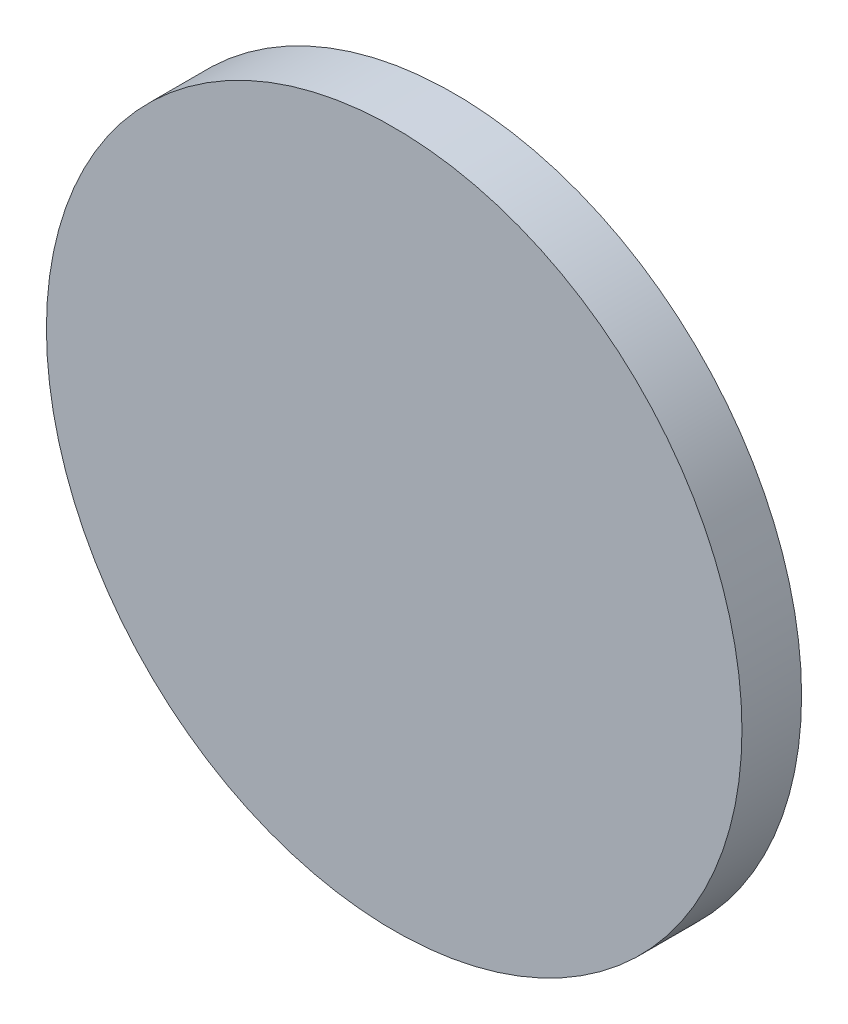
ISO-10303-21;
HEADER;
FILE_DESCRIPTION(('STEP AP214'),'2;1');
FILE_NAME('part.step','',(''),(''),'','','');
FILE_SCHEMA(('AUTOMOTIVE_DESIGN { 1 0 10303 214 1 1 1 1 }'));
ENDSEC;
DATA;
#1=APPLICATION_CONTEXT('core data for automotive mechanical design processes');
#2=APPLICATION_PROTOCOL_DEFINITION('international standard','automotive_design',2000,#1);
#3=PRODUCT_CONTEXT('',#1,'mechanical');
#4=PRODUCT('Part','Part','',(#3));
#5=PRODUCT_RELATED_PRODUCT_CATEGORY('part','',(#4));
#6=PRODUCT_DEFINITION_FORMATION('','',#4);
#7=PRODUCT_DEFINITION_CONTEXT('part definition',#1,'design');
#8=PRODUCT_DEFINITION('design','',#6,#7);
#9=PRODUCT_DEFINITION_SHAPE('','',#8);
#10=(LENGTH_UNIT() NAMED_UNIT(*) SI_UNIT(.MILLI.,.METRE.));
#11=(NAMED_UNIT(*) PLANE_ANGLE_UNIT() SI_UNIT($,.RADIAN.));
#12=(NAMED_UNIT(*) SI_UNIT($,.STERADIAN.) SOLID_ANGLE_UNIT());
#13=UNCERTAINTY_MEASURE_WITH_UNIT(LENGTH_MEASURE(1.E-05),#10,'distance_accuracy_value','');
#14=(GEOMETRIC_REPRESENTATION_CONTEXT(3) GLOBAL_UNCERTAINTY_ASSIGNED_CONTEXT((#13)) GLOBAL_UNIT_ASSIGNED_CONTEXT((#10,
#11,#12)) REPRESENTATION_CONTEXT('',''));
#15=CARTESIAN_POINT('',(0.,0.,0.));
#16=DIRECTION('',(0.,0.,1.));
#17=DIRECTION('',(1.,0.,0.));
#18=AXIS2_PLACEMENT_3D('',#15,#16,#17);
#19=CARTESIAN_POINT('',(4.6101,9.7663,0.));
#20=DIRECTION('',(0.,0.,-1.));
#21=DIRECTION('',(-1.,0.,0.));
#22=AXIS2_PLACEMENT_3D('',#19,#20,#21);
#23=PLANE('',#22);
#24=CARTESIAN_POINT('',(4.6101,9.7663,0.));
#25=DIRECTION('',(0.,0.,1.));
#26=DIRECTION('',(1.,0.,0.));
#27=AXIS2_PLACEMENT_3D('',#24,#25,#26);
#28=CIRCLE('',#27,0.200024667);
#29=CARTESIAN_POINT('',(4.810124667,9.7663,0.));
#30=VERTEX_POINT('',#29);
#31=EDGE_CURVE('E18',#30,#30,#28,.T.);
#32=ORIENTED_EDGE('',*,*,#31,.F.);
#33=EDGE_LOOP('',(#32));
#34=FACE_BOUND('',#33,.T.);
#35=ADVANCED_FACE('F15',(#34),#23,.T.);
#36=CARTESIAN_POINT('',(4.6101,9.7663,0.));
#37=DIRECTION('',(0.,0.,1.));
#38=DIRECTION('',(1.,0.,0.));
#39=AXIS2_PLACEMENT_3D('',#36,#37,#38);
#40=CYLINDRICAL_SURFACE('',#39,0.200024667);
#41=CARTESIAN_POINT('',(4.6101,9.7663,0.03429));
#42=DIRECTION('',(0.,0.,1.));
#43=DIRECTION('',(1.,0.,0.));
#44=AXIS2_PLACEMENT_3D('',#41,#42,#43);
#45=CIRCLE('',#44,0.200024667);
#46=CARTESIAN_POINT('',(4.810124667,9.7663,0.03429));
#47=VERTEX_POINT('',#46);
#48=EDGE_CURVE('E10',#47,#47,#45,.T.);
#49=ORIENTED_EDGE('',*,*,#48,.F.);
#50=EDGE_LOOP('',(#49));
#51=FACE_BOUND('',#50,.T.);
#52=ORIENTED_EDGE('',*,*,#31,.T.);
#53=EDGE_LOOP('',(#52));
#54=FACE_BOUND('',#53,.T.);
#55=ADVANCED_FACE('F27',(#51,#54),#40,.T.);
#56=CARTESIAN_POINT('',(4.6101,9.7663,0.03429));
#57=DIRECTION('',(0.,0.,1.));
#58=DIRECTION('',(1.,0.,0.));
#59=AXIS2_PLACEMENT_3D('',#56,#57,#58);
#60=PLANE('',#59);
#61=ORIENTED_EDGE('',*,*,#48,.T.);
#62=EDGE_LOOP('',(#61));
#63=FACE_BOUND('',#62,.T.);
#64=ADVANCED_FACE('F34',(#63),#60,.T.);
#65=CLOSED_SHELL('',(#35,#55,#64));
#66=MANIFOLD_SOLID_BREP('B1',#65);
#67=ADVANCED_BREP_SHAPE_REPRESENTATION('',(#18,#66),#14);
#68=SHAPE_DEFINITION_REPRESENTATION(#9,#67);
ENDSEC;
END-ISO-10303-21;
